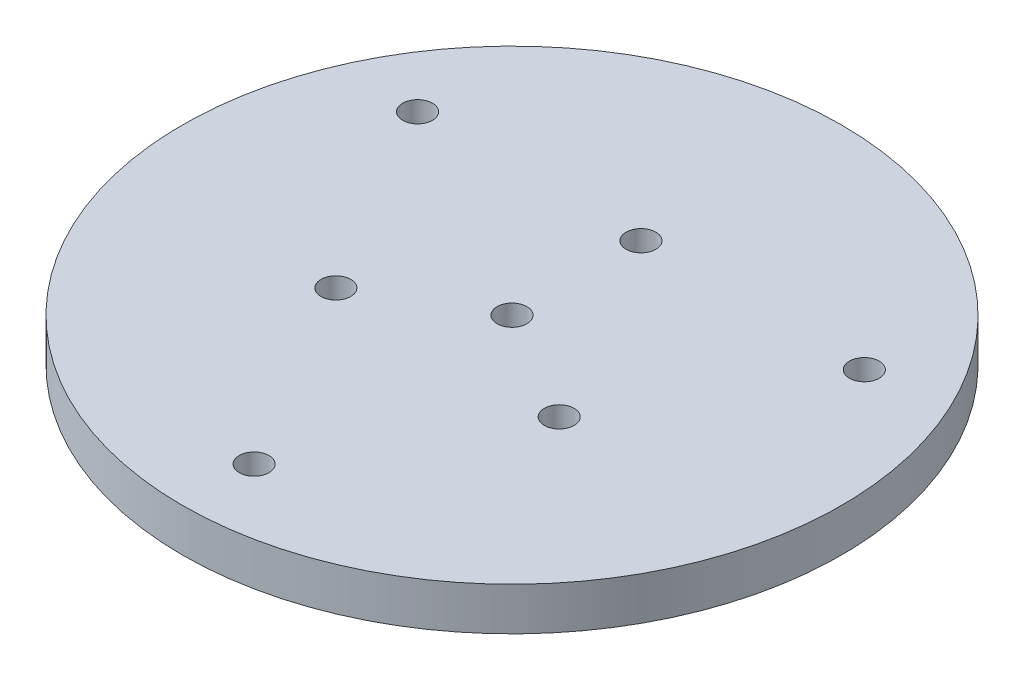
ISO-10303-21;
HEADER;
FILE_DESCRIPTION(('STEP AP214'),'2;1');
FILE_NAME('part.step','',(''),(''),'','','');
FILE_SCHEMA(('AUTOMOTIVE_DESIGN { 1 0 10303 214 1 1 1 1 }'));
ENDSEC;
DATA;
#1=APPLICATION_CONTEXT('core data for automotive mechanical design processes');
#2=APPLICATION_PROTOCOL_DEFINITION('international standard','automotive_design',2000,#1);
#3=PRODUCT_CONTEXT('',#1,'mechanical');
#4=PRODUCT('Part','Part','',(#3));
#5=PRODUCT_RELATED_PRODUCT_CATEGORY('part','',(#4));
#6=PRODUCT_DEFINITION_FORMATION('','',#4);
#7=PRODUCT_DEFINITION_CONTEXT('part definition',#1,'design');
#8=PRODUCT_DEFINITION('design','',#6,#7);
#9=PRODUCT_DEFINITION_SHAPE('','',#8);
#10=(LENGTH_UNIT() NAMED_UNIT(*) SI_UNIT(.MILLI.,.METRE.));
#11=(NAMED_UNIT(*) PLANE_ANGLE_UNIT() SI_UNIT($,.RADIAN.));
#12=(NAMED_UNIT(*) SI_UNIT($,.STERADIAN.) SOLID_ANGLE_UNIT());
#13=UNCERTAINTY_MEASURE_WITH_UNIT(LENGTH_MEASURE(1.E-05),#10,'distance_accuracy_value','');
#14=(GEOMETRIC_REPRESENTATION_CONTEXT(3) GLOBAL_UNCERTAINTY_ASSIGNED_CONTEXT((#13)) GLOBAL_UNIT_ASSIGNED_CONTEXT((#10,
#11,#12)) REPRESENTATION_CONTEXT('',''));
#15=CARTESIAN_POINT('',(0.,0.,0.));
#16=DIRECTION('',(0.,0.,1.));
#17=DIRECTION('',(1.,0.,0.));
#18=AXIS2_PLACEMENT_3D('',#15,#16,#17);
#19=CARTESIAN_POINT('',(0.,4.7625,0.));
#20=DIRECTION('',(0.,1.,0.));
#21=DIRECTION('',(0.,0.,1.));
#22=AXIS2_PLACEMENT_3D('',#19,#20,#21);
#23=PLANE('',#22);
#24=CARTESIAN_POINT('',(-24.7466759131403,4.7625,14.2875));
#25=DIRECTION('',(0.,1.,0.));
#26=DIRECTION('',(0.,0.,1.));
#27=AXIS2_PLACEMENT_3D('',#24,#25,#26);
#28=CIRCLE('',#27,3.29999999999988);
#29=CARTESIAN_POINT('',(-24.7466759131403,4.7625,17.5874999999999));
#30=VERTEX_POINT('',#29);
#31=EDGE_CURVE('E92',#30,#30,#28,.T.);
#32=ORIENTED_EDGE('',*,*,#31,.F.);
#33=EDGE_LOOP('',(#32));
#34=FACE_BOUND('',#33,.T.);
#35=CARTESIAN_POINT('',(49.4933518262807,4.7625,-28.575));
#36=DIRECTION('',(0.,1.,0.));
#37=DIRECTION('',(0.,0.,1.));
#38=AXIS2_PLACEMENT_3D('',#35,#36,#37);
#39=CIRCLE('',#38,3.3);
#40=CARTESIAN_POINT('',(49.4933518262807,4.7625,-25.275));
#41=VERTEX_POINT('',#40);
#42=EDGE_CURVE('E76',#41,#41,#39,.T.);
#43=ORIENTED_EDGE('',*,*,#42,.F.);
#44=EDGE_LOOP('',(#43));
#45=FACE_BOUND('',#44,.T.);
#46=CARTESIAN_POINT('',(0.,4.7625,57.15));
#47=DIRECTION('',(0.,1.,0.));
#48=DIRECTION('',(0.,0.,1.));
#49=AXIS2_PLACEMENT_3D('',#46,#47,#48);
#50=CIRCLE('',#49,3.3);
#51=CARTESIAN_POINT('',(0.,4.7625,60.45));
#52=VERTEX_POINT('',#51);
#53=EDGE_CURVE('E60',#52,#52,#50,.T.);
#54=ORIENTED_EDGE('',*,*,#53,.F.);
#55=EDGE_LOOP('',(#54));
#56=FACE_BOUND('',#55,.T.);
#57=CARTESIAN_POINT('',(0.,4.7625,0.));
#58=DIRECTION('',(0.,1.,0.));
#59=DIRECTION('',(0.,0.,1.));
#60=AXIS2_PLACEMENT_3D('',#57,#58,#59);
#61=CIRCLE('',#60,73.025);
#62=CARTESIAN_POINT('',(0.,4.7625,73.025));
#63=VERTEX_POINT('',#62);
#64=EDGE_CURVE('E10',#63,#63,#61,.T.);
#65=ORIENTED_EDGE('',*,*,#64,.T.);
#66=EDGE_LOOP('',(#65));
#67=FACE_BOUND('',#66,.T.);
#68=CARTESIAN_POINT('',(0.,4.7625,0.));
#69=DIRECTION('',(0.,1.,0.));
#70=DIRECTION('',(0.,0.,1.));
#71=AXIS2_PLACEMENT_3D('',#68,#69,#70);
#72=CIRCLE('',#71,3.3);
#73=CARTESIAN_POINT('',(0.,4.7625,3.3));
#74=VERTEX_POINT('',#73);
#75=EDGE_CURVE('E54',#74,#74,#72,.T.);
#76=ORIENTED_EDGE('',*,*,#75,.F.);
#77=EDGE_LOOP('',(#76));
#78=FACE_BOUND('',#77,.T.);
#79=CARTESIAN_POINT('',(-49.4933518262807,4.7625,-28.575));
#80=DIRECTION('',(0.,1.,0.));
#81=DIRECTION('',(0.,0.,1.));
#82=AXIS2_PLACEMENT_3D('',#79,#80,#81);
#83=CIRCLE('',#82,3.3);
#84=CARTESIAN_POINT('',(-49.4933518262807,4.7625,-25.275));
#85=VERTEX_POINT('',#84);
#86=EDGE_CURVE('E68',#85,#85,#83,.T.);
#87=ORIENTED_EDGE('',*,*,#86,.F.);
#88=EDGE_LOOP('',(#87));
#89=FACE_BOUND('',#88,.T.);
#90=CARTESIAN_POINT('',(24.7466759131403,4.7625,14.2875));
#91=DIRECTION('',(0.,1.,0.));
#92=DIRECTION('',(0.,0.,1.));
#93=AXIS2_PLACEMENT_3D('',#90,#91,#92);
#94=CIRCLE('',#93,3.3);
#95=CARTESIAN_POINT('',(24.7466759131403,4.7625,17.5875));
#96=VERTEX_POINT('',#95);
#97=EDGE_CURVE('E84',#96,#96,#94,.T.);
#98=ORIENTED_EDGE('',*,*,#97,.F.);
#99=EDGE_LOOP('',(#98));
#100=FACE_BOUND('',#99,.T.);
#101=CARTESIAN_POINT('',(0.,4.7625,-28.575));
#102=DIRECTION('',(0.,1.,0.));
#103=DIRECTION('',(0.,0.,1.));
#104=AXIS2_PLACEMENT_3D('',#101,#102,#103);
#105=CIRCLE('',#104,3.29999999999978);
#106=CARTESIAN_POINT('',(0.,4.7625,-25.2750000000002));
#107=VERTEX_POINT('',#106);
#108=EDGE_CURVE('E100',#107,#107,#105,.T.);
#109=ORIENTED_EDGE('',*,*,#108,.F.);
#110=EDGE_LOOP('',(#109));
#111=FACE_BOUND('',#110,.T.);
#112=ADVANCED_FACE('F41',(#34,#45,#56,#67,#78,#89,#100,#111),#23,.T.);
#113=CARTESIAN_POINT('',(0.,-4.7625,0.));
#114=DIRECTION('',(0.,1.,0.));
#115=DIRECTION('',(0.,0.,1.));
#116=AXIS2_PLACEMENT_3D('',#113,#114,#115);
#117=PLANE('',#116);
#118=CARTESIAN_POINT('',(0.,-4.7625,0.));
#119=DIRECTION('',(0.,1.,0.));
#120=DIRECTION('',(0.,0.,1.));
#121=AXIS2_PLACEMENT_3D('',#118,#119,#120);
#122=CIRCLE('',#121,73.025);
#123=CARTESIAN_POINT('',(0.,-4.7625,73.025));
#124=VERTEX_POINT('',#123);
#125=EDGE_CURVE('E45',#124,#124,#122,.T.);
#126=ORIENTED_EDGE('',*,*,#125,.F.);
#127=EDGE_LOOP('',(#126));
#128=FACE_BOUND('',#127,.T.);
#129=CARTESIAN_POINT('',(0.,-4.7625,0.));
#130=DIRECTION('',(0.,1.,0.));
#131=DIRECTION('',(0.,0.,1.));
#132=AXIS2_PLACEMENT_3D('',#129,#130,#131);
#133=CIRCLE('',#132,3.3);
#134=CARTESIAN_POINT('',(0.,-4.7625,3.3));
#135=VERTEX_POINT('',#134);
#136=EDGE_CURVE('E56',#135,#135,#133,.T.);
#137=ORIENTED_EDGE('',*,*,#136,.T.);
#138=EDGE_LOOP('',(#137));
#139=FACE_BOUND('',#138,.T.);
#140=CARTESIAN_POINT('',(0.,-4.7625,57.15));
#141=DIRECTION('',(0.,1.,0.));
#142=DIRECTION('',(0.,0.,1.));
#143=AXIS2_PLACEMENT_3D('',#140,#141,#142);
#144=CIRCLE('',#143,3.3);
#145=CARTESIAN_POINT('',(0.,-4.7625,60.45));
#146=VERTEX_POINT('',#145);
#147=EDGE_CURVE('E64',#146,#146,#144,.T.);
#148=ORIENTED_EDGE('',*,*,#147,.T.);
#149=EDGE_LOOP('',(#148));
#150=FACE_BOUND('',#149,.T.);
#151=CARTESIAN_POINT('',(-49.4933518262807,-4.7625,-28.575));
#152=DIRECTION('',(0.,1.,0.));
#153=DIRECTION('',(0.,0.,1.));
#154=AXIS2_PLACEMENT_3D('',#151,#152,#153);
#155=CIRCLE('',#154,3.3);
#156=CARTESIAN_POINT('',(-49.4933518262807,-4.7625,-25.275));
#157=VERTEX_POINT('',#156);
#158=EDGE_CURVE('E72',#157,#157,#155,.T.);
#159=ORIENTED_EDGE('',*,*,#158,.T.);
#160=EDGE_LOOP('',(#159));
#161=FACE_BOUND('',#160,.T.);
#162=CARTESIAN_POINT('',(49.4933518262807,-4.7625,-28.575));
#163=DIRECTION('',(0.,1.,0.));
#164=DIRECTION('',(0.,0.,1.));
#165=AXIS2_PLACEMENT_3D('',#162,#163,#164);
#166=CIRCLE('',#165,3.3);
#167=CARTESIAN_POINT('',(49.4933518262807,-4.7625,-25.275));
#168=VERTEX_POINT('',#167);
#169=EDGE_CURVE('E80',#168,#168,#166,.T.);
#170=ORIENTED_EDGE('',*,*,#169,.T.);
#171=EDGE_LOOP('',(#170));
#172=FACE_BOUND('',#171,.T.);
#173=CARTESIAN_POINT('',(24.7466759131403,-4.7625,14.2875));
#174=DIRECTION('',(0.,1.,0.));
#175=DIRECTION('',(0.,0.,1.));
#176=AXIS2_PLACEMENT_3D('',#173,#174,#175);
#177=CIRCLE('',#176,3.3);
#178=CARTESIAN_POINT('',(24.7466759131403,-4.7625,17.5875));
#179=VERTEX_POINT('',#178);
#180=EDGE_CURVE('E88',#179,#179,#177,.T.);
#181=ORIENTED_EDGE('',*,*,#180,.T.);
#182=EDGE_LOOP('',(#181));
#183=FACE_BOUND('',#182,.T.);
#184=CARTESIAN_POINT('',(-24.7466759131403,-4.7625,14.2875));
#185=DIRECTION('',(0.,1.,0.));
#186=DIRECTION('',(0.,0.,1.));
#187=AXIS2_PLACEMENT_3D('',#184,#185,#186);
#188=CIRCLE('',#187,3.29999999999988);
#189=CARTESIAN_POINT('',(-24.7466759131403,-4.7625,17.5874999999999));
#190=VERTEX_POINT('',#189);
#191=EDGE_CURVE('E96',#190,#190,#188,.T.);
#192=ORIENTED_EDGE('',*,*,#191,.T.);
#193=EDGE_LOOP('',(#192));
#194=FACE_BOUND('',#193,.T.);
#195=CARTESIAN_POINT('',(0.,-4.7625,-28.575));
#196=DIRECTION('',(0.,1.,0.));
#197=DIRECTION('',(0.,0.,1.));
#198=AXIS2_PLACEMENT_3D('',#195,#196,#197);
#199=CIRCLE('',#198,3.29999999999978);
#200=CARTESIAN_POINT('',(0.,-4.7625,-25.2750000000002));
#201=VERTEX_POINT('',#200);
#202=EDGE_CURVE('E104',#201,#201,#199,.T.);
#203=ORIENTED_EDGE('',*,*,#202,.T.);
#204=EDGE_LOOP('',(#203));
#205=FACE_BOUND('',#204,.T.);
#206=ADVANCED_FACE('F116',(#128,#139,#150,#161,#172,#183,#194,#205),#117,.F.);
#207=CARTESIAN_POINT('',(0.,4.7625,0.));
#208=DIRECTION('',(0.,-1.,0.));
#209=DIRECTION('',(0.,0.,-1.));
#210=AXIS2_PLACEMENT_3D('',#207,#208,#209);
#211=CYLINDRICAL_SURFACE('',#210,73.025);
#212=ORIENTED_EDGE('',*,*,#64,.F.);
#213=EDGE_LOOP('',(#212));
#214=FACE_BOUND('',#213,.T.);
#215=ORIENTED_EDGE('',*,*,#125,.T.);
#216=EDGE_LOOP('',(#215));
#217=FACE_BOUND('',#216,.T.);
#218=ADVANCED_FACE('F43',(#214,#217),#211,.T.);
#219=CARTESIAN_POINT('',(0.,4.7625,0.));
#220=DIRECTION('',(0.,-1.,0.));
#221=DIRECTION('',(0.,0.,-1.));
#222=AXIS2_PLACEMENT_3D('',#219,#220,#221);
#223=CYLINDRICAL_SURFACE('',#222,3.3);
#224=ORIENTED_EDGE('',*,*,#75,.T.);
#225=EDGE_LOOP('',(#224));
#226=FACE_BOUND('',#225,.T.);
#227=ORIENTED_EDGE('',*,*,#136,.F.);
#228=EDGE_LOOP('',(#227));
#229=FACE_BOUND('',#228,.T.);
#230=ADVANCED_FACE('F126',(#226,#229),#223,.F.);
#231=CARTESIAN_POINT('',(0.,4.7625,57.15));
#232=DIRECTION('',(0.,-1.,0.));
#233=DIRECTION('',(0.,0.,-1.));
#234=AXIS2_PLACEMENT_3D('',#231,#232,#233);
#235=CYLINDRICAL_SURFACE('',#234,3.3);
#236=ORIENTED_EDGE('',*,*,#53,.T.);
#237=EDGE_LOOP('',(#236));
#238=FACE_BOUND('',#237,.T.);
#239=ORIENTED_EDGE('',*,*,#147,.F.);
#240=EDGE_LOOP('',(#239));
#241=FACE_BOUND('',#240,.T.);
#242=ADVANCED_FACE('F129',(#238,#241),#235,.F.);
#243=CARTESIAN_POINT('',(-49.4933518262807,4.7625,-28.575));
#244=DIRECTION('',(0.,-1.,0.));
#245=DIRECTION('',(0.,0.,-1.));
#246=AXIS2_PLACEMENT_3D('',#243,#244,#245);
#247=CYLINDRICAL_SURFACE('',#246,3.3);
#248=ORIENTED_EDGE('',*,*,#86,.T.);
#249=EDGE_LOOP('',(#248));
#250=FACE_BOUND('',#249,.T.);
#251=ORIENTED_EDGE('',*,*,#158,.F.);
#252=EDGE_LOOP('',(#251));
#253=FACE_BOUND('',#252,.T.);
#254=ADVANCED_FACE('F133',(#250,#253),#247,.F.);
#255=CARTESIAN_POINT('',(49.4933518262807,4.7625,-28.575));
#256=DIRECTION('',(0.,-1.,0.));
#257=DIRECTION('',(0.,0.,-1.));
#258=AXIS2_PLACEMENT_3D('',#255,#256,#257);
#259=CYLINDRICAL_SURFACE('',#258,3.3);
#260=ORIENTED_EDGE('',*,*,#42,.T.);
#261=EDGE_LOOP('',(#260));
#262=FACE_BOUND('',#261,.T.);
#263=ORIENTED_EDGE('',*,*,#169,.F.);
#264=EDGE_LOOP('',(#263));
#265=FACE_BOUND('',#264,.T.);
#266=ADVANCED_FACE('F137',(#262,#265),#259,.F.);
#267=CARTESIAN_POINT('',(24.7466759131403,4.7625,14.2875));
#268=DIRECTION('',(0.,-1.,0.));
#269=DIRECTION('',(0.,0.,-1.));
#270=AXIS2_PLACEMENT_3D('',#267,#268,#269);
#271=CYLINDRICAL_SURFACE('',#270,3.3);
#272=ORIENTED_EDGE('',*,*,#97,.T.);
#273=EDGE_LOOP('',(#272));
#274=FACE_BOUND('',#273,.T.);
#275=ORIENTED_EDGE('',*,*,#180,.F.);
#276=EDGE_LOOP('',(#275));
#277=FACE_BOUND('',#276,.T.);
#278=ADVANCED_FACE('F141',(#274,#277),#271,.F.);
#279=CARTESIAN_POINT('',(-24.7466759131403,4.7625,14.2875));
#280=DIRECTION('',(0.,-1.,0.));
#281=DIRECTION('',(0.,0.,-1.));
#282=AXIS2_PLACEMENT_3D('',#279,#280,#281);
#283=CYLINDRICAL_SURFACE('',#282,3.29999999999988);
#284=ORIENTED_EDGE('',*,*,#31,.T.);
#285=EDGE_LOOP('',(#284));
#286=FACE_BOUND('',#285,.T.);
#287=ORIENTED_EDGE('',*,*,#191,.F.);
#288=EDGE_LOOP('',(#287));
#289=FACE_BOUND('',#288,.T.);
#290=ADVANCED_FACE('F145',(#286,#289),#283,.F.);
#291=CARTESIAN_POINT('',(0.,4.7625,-28.575));
#292=DIRECTION('',(0.,-1.,0.));
#293=DIRECTION('',(0.,0.,-1.));
#294=AXIS2_PLACEMENT_3D('',#291,#292,#293);
#295=CYLINDRICAL_SURFACE('',#294,3.29999999999978);
#296=ORIENTED_EDGE('',*,*,#108,.T.);
#297=EDGE_LOOP('',(#296));
#298=FACE_BOUND('',#297,.T.);
#299=ORIENTED_EDGE('',*,*,#202,.F.);
#300=EDGE_LOOP('',(#299));
#301=FACE_BOUND('',#300,.T.);
#302=ADVANCED_FACE('F112',(#298,#301),#295,.F.);
#303=CLOSED_SHELL('',(#112,#206,#218,#230,#242,#254,#266,#278,#290,#302));
#304=MANIFOLD_SOLID_BREP('B2',#303);
#305=ADVANCED_BREP_SHAPE_REPRESENTATION('',(#18,#304),#14);
#306=SHAPE_DEFINITION_REPRESENTATION(#9,#305);
ENDSEC;
END-ISO-10303-21;
